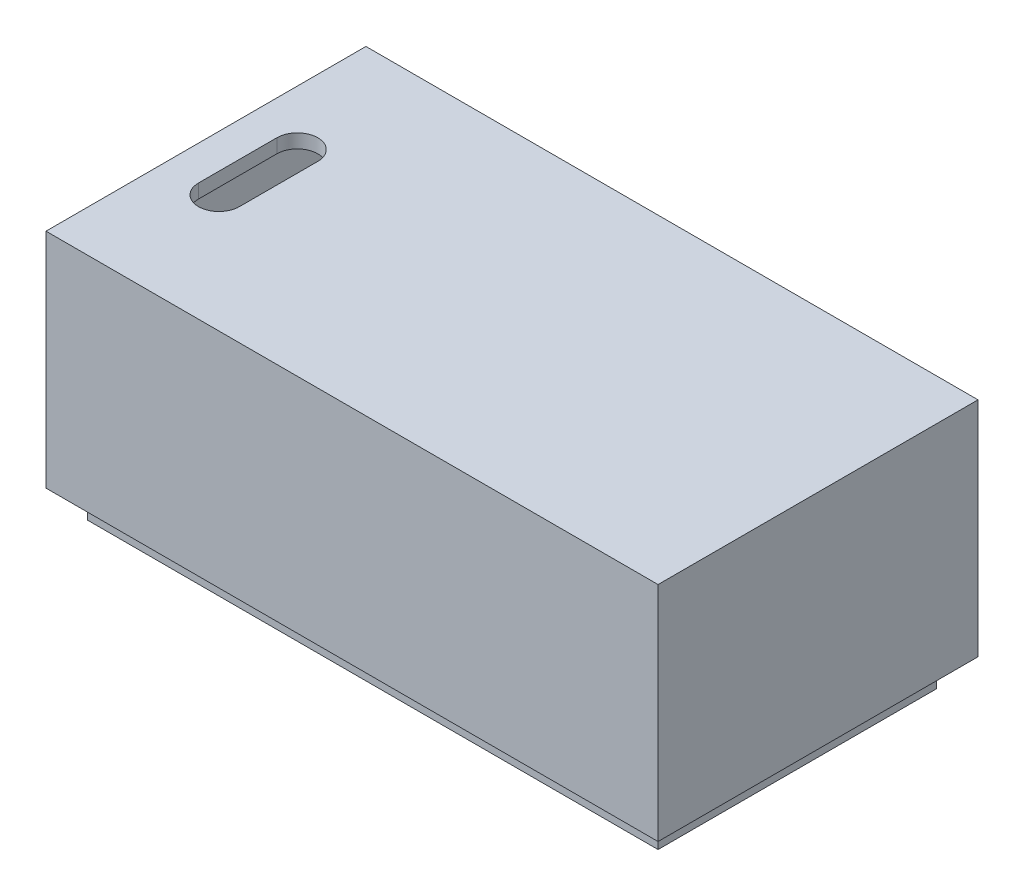
ISO-10303-21;
HEADER;
FILE_DESCRIPTION(('STEP AP214'),'2;1');
FILE_NAME('part.step','',(''),(''),'','','');
FILE_SCHEMA(('AUTOMOTIVE_DESIGN { 1 0 10303 214 1 1 1 1 }'));
ENDSEC;
DATA;
#1=APPLICATION_CONTEXT('core data for automotive mechanical design processes');
#2=APPLICATION_PROTOCOL_DEFINITION('international standard','automotive_design',2000,#1);
#3=PRODUCT_CONTEXT('',#1,'mechanical');
#4=PRODUCT('Part','Part','',(#3));
#5=PRODUCT_RELATED_PRODUCT_CATEGORY('part','',(#4));
#6=PRODUCT_DEFINITION_FORMATION('','',#4);
#7=PRODUCT_DEFINITION_CONTEXT('part definition',#1,'design');
#8=PRODUCT_DEFINITION('design','',#6,#7);
#9=PRODUCT_DEFINITION_SHAPE('','',#8);
#10=(LENGTH_UNIT() NAMED_UNIT(*) SI_UNIT(.MILLI.,.METRE.));
#11=(NAMED_UNIT(*) PLANE_ANGLE_UNIT() SI_UNIT($,.RADIAN.));
#12=(NAMED_UNIT(*) SI_UNIT($,.STERADIAN.) SOLID_ANGLE_UNIT());
#13=UNCERTAINTY_MEASURE_WITH_UNIT(LENGTH_MEASURE(1.E-05),#10,'distance_accuracy_value','');
#14=(GEOMETRIC_REPRESENTATION_CONTEXT(3) GLOBAL_UNCERTAINTY_ASSIGNED_CONTEXT((#13)) GLOBAL_UNIT_ASSIGNED_CONTEXT((#10,
#11,#12)) REPRESENTATION_CONTEXT('',''));
#15=CARTESIAN_POINT('',(0.,0.,0.));
#16=DIRECTION('',(0.,0.,1.));
#17=DIRECTION('',(1.,0.,0.));
#18=AXIS2_PLACEMENT_3D('',#15,#16,#17);
#19=CARTESIAN_POINT('',(0.,20.32,0.));
#20=DIRECTION('',(1.,0.,0.));
#21=DIRECTION('',(0.,0.,-1.));
#22=AXIS2_PLACEMENT_3D('',#19,#20,#21);
#23=PLANE('',#22);
#24=DIRECTION('',(0.,0.,1.));
#25=VECTOR('',#24,1.);
#26=CARTESIAN_POINT('',(0.,0.,0.));
#27=LINE('',#26,#25);
#28=CARTESIAN_POINT('',(0.,0.,-29.21));
#29=VERTEX_POINT('',#28);
#30=CARTESIAN_POINT('',(0.,0.,0.));
#31=VERTEX_POINT('',#30);
#32=EDGE_CURVE('E317',#29,#31,#27,.T.);
#33=ORIENTED_EDGE('',*,*,#32,.T.);
#34=DIRECTION('',(0.,-1.,0.));
#35=VECTOR('',#34,1.);
#36=CARTESIAN_POINT('',(0.,20.32,0.));
#37=LINE('',#36,#35);
#38=CARTESIAN_POINT('',(0.,20.32,0.));
#39=VERTEX_POINT('',#38);
#40=EDGE_CURVE('E11',#39,#31,#37,.T.);
#41=ORIENTED_EDGE('',*,*,#40,.F.);
#42=DIRECTION('',(0.,0.,1.));
#43=VECTOR('',#42,1.);
#44=CARTESIAN_POINT('',(0.,20.32,0.));
#45=LINE('',#44,#43);
#46=CARTESIAN_POINT('',(0.,20.32,-29.21));
#47=VERTEX_POINT('',#46);
#48=EDGE_CURVE('E327',#47,#39,#45,.T.);
#49=ORIENTED_EDGE('',*,*,#48,.F.);
#50=DIRECTION('',(0.,-1.,0.));
#51=VECTOR('',#50,1.);
#52=CARTESIAN_POINT('',(0.,20.32,-29.21));
#53=LINE('',#52,#51);
#54=EDGE_CURVE('E341',#47,#29,#53,.T.);
#55=ORIENTED_EDGE('',*,*,#54,.T.);
#56=EDGE_LOOP('',(#33,#41,#49,#55));
#57=FACE_BOUND('',#56,.T.);
#58=ADVANCED_FACE('F43',(#57),#23,.F.);
#59=CARTESIAN_POINT('',(0.,20.32,0.));
#60=DIRECTION('',(0.,0.,-1.));
#61=DIRECTION('',(-1.,0.,0.));
#62=AXIS2_PLACEMENT_3D('',#59,#60,#61);
#63=PLANE('',#62);
#64=DIRECTION('',(1.,0.,0.));
#65=VECTOR('',#64,1.);
#66=CARTESIAN_POINT('',(0.,0.,0.));
#67=LINE('',#66,#65);
#68=CARTESIAN_POINT('',(55.88,0.,0.));
#69=VERTEX_POINT('',#68);
#70=EDGE_CURVE('E345',#31,#69,#67,.T.);
#71=ORIENTED_EDGE('',*,*,#70,.T.);
#72=DIRECTION('',(0.,-1.,0.));
#73=VECTOR('',#72,1.);
#74=CARTESIAN_POINT('',(55.88,20.32,0.));
#75=LINE('',#74,#73);
#76=CARTESIAN_POINT('',(55.88,20.32,0.));
#77=VERTEX_POINT('',#76);
#78=EDGE_CURVE('E51',#77,#69,#75,.T.);
#79=ORIENTED_EDGE('',*,*,#78,.F.);
#80=DIRECTION('',(1.,0.,0.));
#81=VECTOR('',#80,1.);
#82=CARTESIAN_POINT('',(0.,20.32,0.));
#83=LINE('',#82,#81);
#84=EDGE_CURVE('E331',#39,#77,#83,.T.);
#85=ORIENTED_EDGE('',*,*,#84,.F.);
#86=ORIENTED_EDGE('',*,*,#40,.T.);
#87=EDGE_LOOP('',(#71,#79,#85,#86));
#88=FACE_BOUND('',#87,.T.);
#89=ADVANCED_FACE('F380',(#88),#63,.F.);
#90=CARTESIAN_POINT('',(55.88,20.32,0.));
#91=DIRECTION('',(-1.,0.,0.));
#92=DIRECTION('',(0.,0.,1.));
#93=AXIS2_PLACEMENT_3D('',#90,#91,#92);
#94=PLANE('',#93);
#95=DIRECTION('',(0.,0.,-1.));
#96=VECTOR('',#95,1.);
#97=CARTESIAN_POINT('',(55.88,0.,0.));
#98=LINE('',#97,#96);
#99=CARTESIAN_POINT('',(55.88,0.,-29.21));
#100=VERTEX_POINT('',#99);
#101=EDGE_CURVE('E348',#69,#100,#98,.T.);
#102=ORIENTED_EDGE('',*,*,#101,.T.);
#103=DIRECTION('',(0.,-1.,0.));
#104=VECTOR('',#103,1.);
#105=CARTESIAN_POINT('',(55.88,20.32,-29.21));
#106=LINE('',#105,#104);
#107=CARTESIAN_POINT('',(55.88,20.32,-29.21));
#108=VERTEX_POINT('',#107);
#109=EDGE_CURVE('E356',#108,#100,#106,.T.);
#110=ORIENTED_EDGE('',*,*,#109,.F.);
#111=DIRECTION('',(0.,0.,-1.));
#112=VECTOR('',#111,1.);
#113=CARTESIAN_POINT('',(55.88,20.32,0.));
#114=LINE('',#113,#112);
#115=EDGE_CURVE('E335',#77,#108,#114,.T.);
#116=ORIENTED_EDGE('',*,*,#115,.F.);
#117=ORIENTED_EDGE('',*,*,#78,.T.);
#118=EDGE_LOOP('',(#102,#110,#116,#117));
#119=FACE_BOUND('',#118,.T.);
#120=ADVANCED_FACE('F365',(#119),#94,.F.);
#121=CARTESIAN_POINT('',(0.,20.32,-29.21));
#122=DIRECTION('',(0.,0.,1.));
#123=DIRECTION('',(1.,0.,0.));
#124=AXIS2_PLACEMENT_3D('',#121,#122,#123);
#125=PLANE('',#124);
#126=DIRECTION('',(0.,1.,0.));
#127=VECTOR('',#126,1.);
#128=CARTESIAN_POINT('',(1.27,1.27,-29.21));
#129=LINE('',#128,#127);
#130=CARTESIAN_POINT('',(1.27,1.27,-29.21));
#131=VERTEX_POINT('',#130);
#132=CARTESIAN_POINT('',(1.27,19.05,-29.21));
#133=VERTEX_POINT('',#132);
#134=EDGE_CURVE('E303',#131,#133,#129,.T.);
#135=ORIENTED_EDGE('',*,*,#134,.F.);
#136=DIRECTION('',(-1.,0.,0.));
#137=VECTOR('',#136,1.);
#138=CARTESIAN_POINT('',(54.61,1.27,-29.21));
#139=LINE('',#138,#137);
#140=CARTESIAN_POINT('',(54.61,1.27,-29.21));
#141=VERTEX_POINT('',#140);
#142=EDGE_CURVE('E282',#141,#131,#139,.T.);
#143=ORIENTED_EDGE('',*,*,#142,.F.);
#144=DIRECTION('',(0.,-1.,0.));
#145=VECTOR('',#144,1.);
#146=CARTESIAN_POINT('',(54.61,19.05,-29.21));
#147=LINE('',#146,#145);
#148=CARTESIAN_POINT('',(54.61,19.05,-29.21));
#149=VERTEX_POINT('',#148);
#150=EDGE_CURVE('E288',#149,#141,#147,.T.);
#151=ORIENTED_EDGE('',*,*,#150,.F.);
#152=DIRECTION('',(1.,0.,0.));
#153=VECTOR('',#152,1.);
#154=CARTESIAN_POINT('',(1.27,19.05,-29.21));
#155=LINE('',#154,#153);
#156=EDGE_CURVE('E307',#133,#149,#155,.T.);
#157=ORIENTED_EDGE('',*,*,#156,.F.);
#158=EDGE_LOOP('',(#135,#143,#151,#157));
#159=FACE_BOUND('',#158,.T.);
#160=DIRECTION('',(-1.,0.,0.));
#161=VECTOR('',#160,1.);
#162=CARTESIAN_POINT('',(0.,0.,-29.21));
#163=LINE('',#162,#161);
#164=EDGE_CURVE('E332',#100,#29,#163,.T.);
#165=ORIENTED_EDGE('',*,*,#164,.T.);
#166=ORIENTED_EDGE('',*,*,#54,.F.);
#167=DIRECTION('',(-1.,0.,0.));
#168=VECTOR('',#167,1.);
#169=CARTESIAN_POINT('',(0.,20.32,-29.21));
#170=LINE('',#169,#168);
#171=EDGE_CURVE('E338',#108,#47,#170,.T.);
#172=ORIENTED_EDGE('',*,*,#171,.F.);
#173=ORIENTED_EDGE('',*,*,#109,.T.);
#174=EDGE_LOOP('',(#165,#166,#172,#173));
#175=FACE_BOUND('',#174,.T.);
#176=ADVANCED_FACE('F373',(#159,#175),#125,.F.);
#177=CARTESIAN_POINT('',(0.,20.32,0.));
#178=DIRECTION('',(0.,-1.,0.));
#179=DIRECTION('',(0.,0.,-1.));
#180=AXIS2_PLACEMENT_3D('',#177,#178,#179);
#181=PLANE('',#180);
#182=CARTESIAN_POINT('',(5.02147706146975,20.32,-10.7691290721729));
#183=DIRECTION('',(0.,1.,0.));
#184=DIRECTION('',(0.,0.,1.));
#185=AXIS2_PLACEMENT_3D('',#182,#183,#184);
#186=CIRCLE('',#185,1.86958414969726);
#187=CARTESIAN_POINT('',(3.15189291177249,20.32,-10.7691290721729));
#188=VERTEX_POINT('',#187);
#189=CARTESIAN_POINT('',(6.89106121116701,20.32,-10.7691290721729));
#190=VERTEX_POINT('',#189);
#191=EDGE_CURVE('E247',#188,#190,#186,.T.);
#192=ORIENTED_EDGE('',*,*,#191,.F.);
#193=DIRECTION('',(0.,0.,1.));
#194=VECTOR('',#193,1.);
#195=CARTESIAN_POINT('',(3.15189291177249,20.32,-17.9251235761866));
#196=LINE('',#195,#194);
#197=CARTESIAN_POINT('',(3.15189291177249,20.32,-17.9251235761866));
#198=VERTEX_POINT('',#197);
#199=EDGE_CURVE('E251',#198,#188,#196,.T.);
#200=ORIENTED_EDGE('',*,*,#199,.F.);
#201=CARTESIAN_POINT('',(5.02147706146975,20.32,-17.9251235761866));
#202=DIRECTION('',(0.,1.,0.));
#203=DIRECTION('',(0.,0.,1.));
#204=AXIS2_PLACEMENT_3D('',#201,#202,#203);
#205=CIRCLE('',#204,1.86958414969726);
#206=CARTESIAN_POINT('',(6.89106121116701,20.32,-17.9251235761866));
#207=VERTEX_POINT('',#206);
#208=EDGE_CURVE('E255',#207,#198,#205,.T.);
#209=ORIENTED_EDGE('',*,*,#208,.F.);
#210=DIRECTION('',(0.,0.,-1.));
#211=VECTOR('',#210,1.);
#212=CARTESIAN_POINT('',(6.89106121116701,20.32,-17.9251235761866));
#213=LINE('',#212,#211);
#214=EDGE_CURVE('E243',#190,#207,#213,.T.);
#215=ORIENTED_EDGE('',*,*,#214,.F.);
#216=EDGE_LOOP('',(#192,#200,#209,#215));
#217=FACE_BOUND('',#216,.T.);
#218=ORIENTED_EDGE('',*,*,#48,.T.);
#219=ORIENTED_EDGE('',*,*,#84,.T.);
#220=ORIENTED_EDGE('',*,*,#115,.T.);
#221=ORIENTED_EDGE('',*,*,#171,.T.);
#222=EDGE_LOOP('',(#218,#219,#220,#221));
#223=FACE_BOUND('',#222,.T.);
#224=ADVANCED_FACE('F379',(#217,#223),#181,.F.);
#225=CARTESIAN_POINT('',(0.,0.,0.));
#226=DIRECTION('',(0.,-1.,0.));
#227=DIRECTION('',(0.,0.,-1.));
#228=AXIS2_PLACEMENT_3D('',#225,#226,#227);
#229=PLANE('',#228);
#230=DIRECTION('',(0.,0.,1.));
#231=VECTOR('',#230,1.);
#232=CARTESIAN_POINT('',(53.975,0.,-27.305));
#233=LINE('',#232,#231);
#234=CARTESIAN_POINT('',(53.975,0.,-2.667));
#235=VERTEX_POINT('',#234);
#236=CARTESIAN_POINT('',(53.975,0.,-1.905));
#237=VERTEX_POINT('',#236);
#238=EDGE_CURVE('E193',#235,#237,#233,.T.);
#239=ORIENTED_EDGE('',*,*,#238,.F.);
#240=DIRECTION('',(-1.,0.,0.));
#241=VECTOR('',#240,1.);
#242=CARTESIAN_POINT('',(55.881,0.,-2.667));
#243=LINE('',#242,#241);
#244=CARTESIAN_POINT('',(1.905,0.,-2.667));
#245=VERTEX_POINT('',#244);
#246=EDGE_CURVE('E178',#235,#245,#243,.T.);
#247=ORIENTED_EDGE('',*,*,#246,.T.);
#248=DIRECTION('',(0.,0.,-1.));
#249=VECTOR('',#248,1.);
#250=CARTESIAN_POINT('',(1.905,0.,-1.905));
#251=LINE('',#250,#249);
#252=CARTESIAN_POINT('',(1.905,0.,-1.905));
#253=VERTEX_POINT('',#252);
#254=EDGE_CURVE('E219',#253,#245,#251,.T.);
#255=ORIENTED_EDGE('',*,*,#254,.F.);
#256=DIRECTION('',(-1.,0.,0.));
#257=VECTOR('',#256,1.);
#258=CARTESIAN_POINT('',(53.975,0.,-1.905));
#259=LINE('',#258,#257);
#260=EDGE_CURVE('E202',#237,#253,#259,.T.);
#261=ORIENTED_EDGE('',*,*,#260,.F.);
#262=EDGE_LOOP('',(#239,#247,#255,#261));
#263=FACE_BOUND('',#262,.T.);
#264=DIRECTION('',(1.,0.,0.));
#265=VECTOR('',#264,1.);
#266=CARTESIAN_POINT('',(1.905,0.,-27.305));
#267=LINE('',#266,#265);
#268=CARTESIAN_POINT('',(1.905,0.,-27.305));
#269=VERTEX_POINT('',#268);
#270=CARTESIAN_POINT('',(53.975,0.,-27.305));
#271=VERTEX_POINT('',#270);
#272=EDGE_CURVE('E206',#269,#271,#267,.T.);
#273=ORIENTED_EDGE('',*,*,#272,.F.);
#274=CARTESIAN_POINT('',(1.905,0.,-26.543));
#275=VERTEX_POINT('',#274);
#276=EDGE_CURVE('E218',#275,#269,#251,.T.);
#277=ORIENTED_EDGE('',*,*,#276,.F.);
#278=DIRECTION('',(-1.,0.,0.));
#279=VECTOR('',#278,1.);
#280=CARTESIAN_POINT('',(55.881,0.,-26.543));
#281=LINE('',#280,#279);
#282=CARTESIAN_POINT('',(53.975,0.,-26.543));
#283=VERTEX_POINT('',#282);
#284=EDGE_CURVE('E187',#283,#275,#281,.T.);
#285=ORIENTED_EDGE('',*,*,#284,.F.);
#286=EDGE_CURVE('E205',#271,#283,#233,.T.);
#287=ORIENTED_EDGE('',*,*,#286,.F.);
#288=EDGE_LOOP('',(#273,#277,#285,#287));
#289=FACE_BOUND('',#288,.T.);
#290=ORIENTED_EDGE('',*,*,#32,.F.);
#291=ORIENTED_EDGE('',*,*,#164,.F.);
#292=ORIENTED_EDGE('',*,*,#101,.F.);
#293=ORIENTED_EDGE('',*,*,#70,.F.);
#294=EDGE_LOOP('',(#290,#291,#292,#293));
#295=FACE_BOUND('',#294,.T.);
#296=ADVANCED_FACE('F199',(#263,#289,#295),#229,.T.);
#297=CARTESIAN_POINT('',(54.61,1.27,-1.26999999999999));
#298=DIRECTION('',(0.,-1.,0.));
#299=DIRECTION('',(0.,0.,-1.));
#300=AXIS2_PLACEMENT_3D('',#297,#298,#299);
#301=PLANE('',#300);
#302=ORIENTED_EDGE('',*,*,#142,.T.);
#303=DIRECTION('',(0.,0.,-1.));
#304=VECTOR('',#303,1.);
#305=CARTESIAN_POINT('',(1.27,1.27,-1.26999999999999));
#306=LINE('',#305,#304);
#307=CARTESIAN_POINT('',(1.27,1.27,-1.26999999999999));
#308=VERTEX_POINT('',#307);
#309=EDGE_CURVE('E300',#308,#131,#306,.T.);
#310=ORIENTED_EDGE('',*,*,#309,.F.);
#311=DIRECTION('',(-1.,0.,0.));
#312=VECTOR('',#311,1.);
#313=CARTESIAN_POINT('',(54.61,1.27,-1.26999999999999));
#314=LINE('',#313,#312);
#315=CARTESIAN_POINT('',(54.61,1.27,-1.26999999999999));
#316=VERTEX_POINT('',#315);
#317=EDGE_CURVE('E283',#316,#308,#314,.T.);
#318=ORIENTED_EDGE('',*,*,#317,.F.);
#319=DIRECTION('',(0.,0.,-1.));
#320=VECTOR('',#319,1.);
#321=CARTESIAN_POINT('',(54.61,1.27,-1.26999999999999));
#322=LINE('',#321,#320);
#323=EDGE_CURVE('E314',#316,#141,#322,.T.);
#324=ORIENTED_EDGE('',*,*,#323,.T.);
#325=EDGE_LOOP('',(#302,#310,#318,#324));
#326=FACE_BOUND('',#325,.T.);
#327=ADVANCED_FACE('F393',(#326),#301,.F.);
#328=CARTESIAN_POINT('',(54.61,19.05,-1.26999999999999));
#329=DIRECTION('',(1.,0.,0.));
#330=DIRECTION('',(0.,0.,-1.));
#331=AXIS2_PLACEMENT_3D('',#328,#329,#330);
#332=PLANE('',#331);
#333=ORIENTED_EDGE('',*,*,#150,.T.);
#334=ORIENTED_EDGE('',*,*,#323,.F.);
#335=DIRECTION('',(0.,-1.,0.));
#336=VECTOR('',#335,1.);
#337=CARTESIAN_POINT('',(54.61,19.05,-1.26999999999999));
#338=LINE('',#337,#336);
#339=CARTESIAN_POINT('',(54.61,19.05,-1.26999999999999));
#340=VERTEX_POINT('',#339);
#341=EDGE_CURVE('E296',#340,#316,#338,.T.);
#342=ORIENTED_EDGE('',*,*,#341,.F.);
#343=DIRECTION('',(0.,0.,-1.));
#344=VECTOR('',#343,1.);
#345=CARTESIAN_POINT('',(54.61,19.05,-1.26999999999999));
#346=LINE('',#345,#344);
#347=EDGE_CURVE('E318',#340,#149,#346,.T.);
#348=ORIENTED_EDGE('',*,*,#347,.T.);
#349=EDGE_LOOP('',(#333,#334,#342,#348));
#350=FACE_BOUND('',#349,.T.);
#351=ADVANCED_FACE('F399',(#350),#332,.F.);
#352=CARTESIAN_POINT('',(1.27,19.05,-1.26999999999999));
#353=DIRECTION('',(0.,1.,0.));
#354=DIRECTION('',(0.,0.,1.));
#355=AXIS2_PLACEMENT_3D('',#352,#353,#354);
#356=PLANE('',#355);
#357=CARTESIAN_POINT('',(5.02147706146975,19.05,-17.9251235761866));
#358=DIRECTION('',(0.,1.,0.));
#359=DIRECTION('',(0.,0.,1.));
#360=AXIS2_PLACEMENT_3D('',#357,#358,#359);
#361=CIRCLE('',#360,1.86958414969726);
#362=CARTESIAN_POINT('',(3.15189291177249,19.05,-17.9251235761866));
#363=VERTEX_POINT('',#362);
#364=CARTESIAN_POINT('',(6.89106121116701,19.05,-17.9251235761866));
#365=VERTEX_POINT('',#364);
#366=EDGE_CURVE('E242',#363,#365,#361,.F.);
#367=ORIENTED_EDGE('',*,*,#366,.F.);
#368=DIRECTION('',(0.,0.,-1.));
#369=VECTOR('',#368,1.);
#370=CARTESIAN_POINT('',(3.15189291177249,19.05,-17.9251235761866));
#371=LINE('',#370,#369);
#372=CARTESIAN_POINT('',(3.15189291177249,19.05,-10.7691290721729));
#373=VERTEX_POINT('',#372);
#374=EDGE_CURVE('E239',#373,#363,#371,.T.);
#375=ORIENTED_EDGE('',*,*,#374,.F.);
#376=CARTESIAN_POINT('',(5.02147706146975,19.05,-10.7691290721729));
#377=DIRECTION('',(0.,1.,0.));
#378=DIRECTION('',(0.,0.,1.));
#379=AXIS2_PLACEMENT_3D('',#376,#377,#378);
#380=CIRCLE('',#379,1.86958414969726);
#381=CARTESIAN_POINT('',(6.89106121116701,19.05,-10.7691290721729));
#382=VERTEX_POINT('',#381);
#383=EDGE_CURVE('E259',#382,#373,#380,.F.);
#384=ORIENTED_EDGE('',*,*,#383,.F.);
#385=DIRECTION('',(0.,0.,1.));
#386=VECTOR('',#385,1.);
#387=CARTESIAN_POINT('',(6.89106121116701,19.05,-17.9251235761866));
#388=LINE('',#387,#386);
#389=EDGE_CURVE('E263',#365,#382,#388,.T.);
#390=ORIENTED_EDGE('',*,*,#389,.F.);
#391=EDGE_LOOP('',(#367,#375,#384,#390));
#392=FACE_BOUND('',#391,.T.);
#393=ORIENTED_EDGE('',*,*,#156,.T.);
#394=ORIENTED_EDGE('',*,*,#347,.F.);
#395=DIRECTION('',(1.,0.,0.));
#396=VECTOR('',#395,1.);
#397=CARTESIAN_POINT('',(1.27,19.05,-1.26999999999999));
#398=LINE('',#397,#396);
#399=CARTESIAN_POINT('',(1.27,19.05,-1.26999999999999));
#400=VERTEX_POINT('',#399);
#401=EDGE_CURVE('E292',#400,#340,#398,.T.);
#402=ORIENTED_EDGE('',*,*,#401,.F.);
#403=DIRECTION('',(0.,0.,-1.));
#404=VECTOR('',#403,1.);
#405=CARTESIAN_POINT('',(1.27,19.05,-1.26999999999999));
#406=LINE('',#405,#404);
#407=EDGE_CURVE('E321',#400,#133,#406,.T.);
#408=ORIENTED_EDGE('',*,*,#407,.T.);
#409=EDGE_LOOP('',(#393,#394,#402,#408));
#410=FACE_BOUND('',#409,.T.);
#411=ADVANCED_FACE('F405',(#392,#410),#356,.F.);
#412=CARTESIAN_POINT('',(1.27,1.27,-1.26999999999999));
#413=DIRECTION('',(-1.,0.,0.));
#414=DIRECTION('',(0.,0.,1.));
#415=AXIS2_PLACEMENT_3D('',#412,#413,#414);
#416=PLANE('',#415);
#417=ORIENTED_EDGE('',*,*,#134,.T.);
#418=ORIENTED_EDGE('',*,*,#407,.F.);
#419=DIRECTION('',(0.,1.,0.));
#420=VECTOR('',#419,1.);
#421=CARTESIAN_POINT('',(1.27,1.27,-1.26999999999999));
#422=LINE('',#421,#420);
#423=EDGE_CURVE('E287',#308,#400,#422,.T.);
#424=ORIENTED_EDGE('',*,*,#423,.F.);
#425=ORIENTED_EDGE('',*,*,#309,.T.);
#426=EDGE_LOOP('',(#417,#418,#424,#425));
#427=FACE_BOUND('',#426,.T.);
#428=ADVANCED_FACE('F401',(#427),#416,.F.);
#429=CARTESIAN_POINT('',(0.,0.,-1.26999999999999));
#430=DIRECTION('',(0.,0.,-1.));
#431=DIRECTION('',(-1.,0.,0.));
#432=AXIS2_PLACEMENT_3D('',#429,#430,#431);
#433=PLANE('',#432);
#434=ORIENTED_EDGE('',*,*,#317,.T.);
#435=ORIENTED_EDGE('',*,*,#423,.T.);
#436=ORIENTED_EDGE('',*,*,#401,.T.);
#437=ORIENTED_EDGE('',*,*,#341,.T.);
#438=EDGE_LOOP('',(#434,#435,#436,#437));
#439=FACE_BOUND('',#438,.T.);
#440=ADVANCED_FACE('F404',(#439),#433,.T.);
#441=CARTESIAN_POINT('',(3.15189291177249,-0.001000000000001,-17.9251235761866));
#442=DIRECTION('',(-1.,0.,0.));
#443=DIRECTION('',(0.,0.,1.));
#444=AXIS2_PLACEMENT_3D('',#441,#442,#443);
#445=PLANE('',#444);
#446=ORIENTED_EDGE('',*,*,#374,.T.);
#447=DIRECTION('',(0.,1.,0.));
#448=VECTOR('',#447,1.);
#449=CARTESIAN_POINT('',(3.15189291177249,-0.001000000000001,-17.9251235761866));
#450=LINE('',#449,#448);
#451=EDGE_CURVE('E274',#363,#198,#450,.T.);
#452=ORIENTED_EDGE('',*,*,#451,.T.);
#453=ORIENTED_EDGE('',*,*,#199,.T.);
#454=DIRECTION('',(0.,1.,0.));
#455=VECTOR('',#454,1.);
#456=CARTESIAN_POINT('',(3.15189291177249,-0.001000000000001,-10.7691290721729));
#457=LINE('',#456,#455);
#458=EDGE_CURVE('E246',#373,#188,#457,.T.);
#459=ORIENTED_EDGE('',*,*,#458,.F.);
#460=EDGE_LOOP('',(#446,#452,#453,#459));
#461=FACE_BOUND('',#460,.T.);
#462=ADVANCED_FACE('F415',(#461),#445,.F.);
#463=CARTESIAN_POINT('',(5.02147706146975,-0.001000000000001,-10.7691290721729));
#464=DIRECTION('',(0.,1.,0.));
#465=DIRECTION('',(0.,0.,1.));
#466=AXIS2_PLACEMENT_3D('',#463,#464,#465);
#467=CYLINDRICAL_SURFACE('',#466,1.86958414969726);
#468=ORIENTED_EDGE('',*,*,#383,.T.);
#469=ORIENTED_EDGE('',*,*,#458,.T.);
#470=ORIENTED_EDGE('',*,*,#191,.T.);
#471=DIRECTION('',(0.,1.,0.));
#472=VECTOR('',#471,1.);
#473=CARTESIAN_POINT('',(6.89106121116701,-0.001000000000001,-10.7691290721729));
#474=LINE('',#473,#472);
#475=EDGE_CURVE('E275',#382,#190,#474,.T.);
#476=ORIENTED_EDGE('',*,*,#475,.F.);
#477=EDGE_LOOP('',(#468,#469,#470,#476));
#478=FACE_BOUND('',#477,.T.);
#479=ADVANCED_FACE('F419',(#478),#467,.F.);
#480=CARTESIAN_POINT('',(6.89106121116701,-0.001000000000001,-17.9251235761866));
#481=DIRECTION('',(1.,0.,0.));
#482=DIRECTION('',(0.,0.,-1.));
#483=AXIS2_PLACEMENT_3D('',#480,#481,#482);
#484=PLANE('',#483);
#485=ORIENTED_EDGE('',*,*,#389,.T.);
#486=ORIENTED_EDGE('',*,*,#475,.T.);
#487=ORIENTED_EDGE('',*,*,#214,.T.);
#488=DIRECTION('',(0.,1.,0.));
#489=VECTOR('',#488,1.);
#490=CARTESIAN_POINT('',(6.89106121116701,-0.001000000000001,-17.9251235761866));
#491=LINE('',#490,#489);
#492=EDGE_CURVE('E270',#365,#207,#491,.T.);
#493=ORIENTED_EDGE('',*,*,#492,.F.);
#494=EDGE_LOOP('',(#485,#486,#487,#493));
#495=FACE_BOUND('',#494,.T.);
#496=ADVANCED_FACE('F423',(#495),#484,.F.);
#497=CARTESIAN_POINT('',(5.02147706146975,-0.001000000000001,-17.9251235761866));
#498=DIRECTION('',(0.,1.,0.));
#499=DIRECTION('',(0.,0.,1.));
#500=AXIS2_PLACEMENT_3D('',#497,#498,#499);
#501=CYLINDRICAL_SURFACE('',#500,1.86958414969726);
#502=ORIENTED_EDGE('',*,*,#366,.T.);
#503=ORIENTED_EDGE('',*,*,#492,.T.);
#504=ORIENTED_EDGE('',*,*,#208,.T.);
#505=ORIENTED_EDGE('',*,*,#451,.F.);
#506=EDGE_LOOP('',(#502,#503,#504,#505));
#507=FACE_BOUND('',#506,.T.);
#508=ADVANCED_FACE('F427',(#507),#501,.F.);
#509=CARTESIAN_POINT('',(1.905,-2.54,-27.305));
#510=DIRECTION('',(0.,0.,1.));
#511=DIRECTION('',(1.,0.,0.));
#512=AXIS2_PLACEMENT_3D('',#509,#510,#511);
#513=PLANE('',#512);
#514=ORIENTED_EDGE('',*,*,#272,.T.);
#515=DIRECTION('',(0.,1.,0.));
#516=VECTOR('',#515,1.);
#517=CARTESIAN_POINT('',(53.975,-2.54,-27.305));
#518=LINE('',#517,#516);
#519=CARTESIAN_POINT('',(53.975,-2.54,-27.305));
#520=VERTEX_POINT('',#519);
#521=EDGE_CURVE('E235',#520,#271,#518,.T.);
#522=ORIENTED_EDGE('',*,*,#521,.F.);
#523=DIRECTION('',(1.,0.,0.));
#524=VECTOR('',#523,1.);
#525=CARTESIAN_POINT('',(1.905,-2.54,-27.305));
#526=LINE('',#525,#524);
#527=CARTESIAN_POINT('',(1.905,-2.54,-27.305));
#528=VERTEX_POINT('',#527);
#529=EDGE_CURVE('E222',#528,#520,#526,.T.);
#530=ORIENTED_EDGE('',*,*,#529,.F.);
#531=DIRECTION('',(0.,1.,0.));
#532=VECTOR('',#531,1.);
#533=CARTESIAN_POINT('',(1.905,-2.54,-27.305));
#534=LINE('',#533,#532);
#535=EDGE_CURVE('E223',#528,#269,#534,.T.);
#536=ORIENTED_EDGE('',*,*,#535,.T.);
#537=EDGE_LOOP('',(#514,#522,#530,#536));
#538=FACE_BOUND('',#537,.T.);
#539=ADVANCED_FACE('F431',(#538),#513,.F.);
#540=CARTESIAN_POINT('',(53.975,-2.54,-27.305));
#541=DIRECTION('',(-1.,0.,0.));
#542=DIRECTION('',(0.,0.,1.));
#543=AXIS2_PLACEMENT_3D('',#540,#541,#542);
#544=PLANE('',#543);
#545=DIRECTION('',(0.,0.,-1.));
#546=VECTOR('',#545,1.);
#547=CARTESIAN_POINT('',(53.975,-1.778,-2.667));
#548=LINE('',#547,#546);
#549=CARTESIAN_POINT('',(53.975,-1.778,-2.667));
#550=VERTEX_POINT('',#549);
#551=CARTESIAN_POINT('',(53.975,-1.778,-26.543));
#552=VERTEX_POINT('',#551);
#553=EDGE_CURVE('E196',#550,#552,#548,.T.);
#554=ORIENTED_EDGE('',*,*,#553,.F.);
#555=DIRECTION('',(0.,-1.,0.));
#556=VECTOR('',#555,1.);
#557=CARTESIAN_POINT('',(53.975,0.,-2.667));
#558=LINE('',#557,#556);
#559=EDGE_CURVE('E181',#235,#550,#558,.T.);
#560=ORIENTED_EDGE('',*,*,#559,.F.);
#561=ORIENTED_EDGE('',*,*,#238,.T.);
#562=DIRECTION('',(0.,1.,0.));
#563=VECTOR('',#562,1.);
#564=CARTESIAN_POINT('',(53.975,-2.54,-1.905));
#565=LINE('',#564,#563);
#566=CARTESIAN_POINT('',(53.975,-2.54,-1.905));
#567=VERTEX_POINT('',#566);
#568=EDGE_CURVE('E232',#567,#237,#565,.T.);
#569=ORIENTED_EDGE('',*,*,#568,.F.);
#570=DIRECTION('',(0.,0.,1.));
#571=VECTOR('',#570,1.);
#572=CARTESIAN_POINT('',(53.975,-2.54,-27.305));
#573=LINE('',#572,#571);
#574=EDGE_CURVE('E484',#520,#567,#573,.T.);
#575=ORIENTED_EDGE('',*,*,#574,.F.);
#576=ORIENTED_EDGE('',*,*,#521,.T.);
#577=ORIENTED_EDGE('',*,*,#286,.T.);
#578=DIRECTION('',(0.,1.,0.));
#579=VECTOR('',#578,1.);
#580=CARTESIAN_POINT('',(53.975,-1.778,-26.543));
#581=LINE('',#580,#579);
#582=EDGE_CURVE('E58',#552,#283,#581,.T.);
#583=ORIENTED_EDGE('',*,*,#582,.F.);
#584=EDGE_LOOP('',(#554,#560,#561,#569,#575,#576,#577,#583));
#585=FACE_BOUND('',#584,.T.);
#586=ADVANCED_FACE('F191',(#585),#544,.F.);
#587=CARTESIAN_POINT('',(53.975,-2.54,-1.905));
#588=DIRECTION('',(0.,0.,-1.));
#589=DIRECTION('',(-1.,0.,0.));
#590=AXIS2_PLACEMENT_3D('',#587,#588,#589);
#591=PLANE('',#590);
#592=ORIENTED_EDGE('',*,*,#260,.T.);
#593=DIRECTION('',(0.,1.,0.));
#594=VECTOR('',#593,1.);
#595=CARTESIAN_POINT('',(1.905,-2.54,-1.905));
#596=LINE('',#595,#594);
#597=CARTESIAN_POINT('',(1.905,-2.54,-1.905));
#598=VERTEX_POINT('',#597);
#599=EDGE_CURVE('E227',#598,#253,#596,.T.);
#600=ORIENTED_EDGE('',*,*,#599,.F.);
#601=DIRECTION('',(-1.,0.,0.));
#602=VECTOR('',#601,1.);
#603=CARTESIAN_POINT('',(53.975,-2.54,-1.905));
#604=LINE('',#603,#602);
#605=EDGE_CURVE('E487',#567,#598,#604,.T.);
#606=ORIENTED_EDGE('',*,*,#605,.F.);
#607=ORIENTED_EDGE('',*,*,#568,.T.);
#608=EDGE_LOOP('',(#592,#600,#606,#607));
#609=FACE_BOUND('',#608,.T.);
#610=ADVANCED_FACE('F438',(#609),#591,.F.);
#611=CARTESIAN_POINT('',(1.905,-2.54,-1.905));
#612=DIRECTION('',(1.,0.,0.));
#613=DIRECTION('',(0.,0.,-1.));
#614=AXIS2_PLACEMENT_3D('',#611,#612,#613);
#615=PLANE('',#614);
#616=ORIENTED_EDGE('',*,*,#254,.T.);
#617=DIRECTION('',(0.,1.,0.));
#618=VECTOR('',#617,1.);
#619=CARTESIAN_POINT('',(1.905,0.,-2.667));
#620=LINE('',#619,#618);
#621=CARTESIAN_POINT('',(1.905,-1.778,-2.667));
#622=VERTEX_POINT('',#621);
#623=EDGE_CURVE('E66',#622,#245,#620,.T.);
#624=ORIENTED_EDGE('',*,*,#623,.F.);
#625=DIRECTION('',(0.,0.,1.));
#626=VECTOR('',#625,1.);
#627=CARTESIAN_POINT('',(1.905,-1.778,-2.667));
#628=LINE('',#627,#626);
#629=CARTESIAN_POINT('',(1.905,-1.778,-26.543));
#630=VERTEX_POINT('',#629);
#631=EDGE_CURVE('E188',#630,#622,#628,.T.);
#632=ORIENTED_EDGE('',*,*,#631,.F.);
#633=DIRECTION('',(0.,-1.,0.));
#634=VECTOR('',#633,1.);
#635=CARTESIAN_POINT('',(1.905,-1.778,-26.543));
#636=LINE('',#635,#634);
#637=EDGE_CURVE('E470',#275,#630,#636,.T.);
#638=ORIENTED_EDGE('',*,*,#637,.F.);
#639=ORIENTED_EDGE('',*,*,#276,.T.);
#640=ORIENTED_EDGE('',*,*,#535,.F.);
#641=DIRECTION('',(0.,0.,-1.));
#642=VECTOR('',#641,1.);
#643=CARTESIAN_POINT('',(1.905,-2.54,-1.905));
#644=LINE('',#643,#642);
#645=EDGE_CURVE('E228',#598,#528,#644,.T.);
#646=ORIENTED_EDGE('',*,*,#645,.F.);
#647=ORIENTED_EDGE('',*,*,#599,.T.);
#648=EDGE_LOOP('',(#616,#624,#632,#638,#639,#640,#646,#647));
#649=FACE_BOUND('',#648,.T.);
#650=ADVANCED_FACE('F441',(#649),#615,.F.);
#651=CARTESIAN_POINT('',(0.,-2.54,0.));
#652=DIRECTION('',(0.,-1.,0.));
#653=DIRECTION('',(0.,0.,-1.));
#654=AXIS2_PLACEMENT_3D('',#651,#652,#653);
#655=PLANE('',#654);
#656=ORIENTED_EDGE('',*,*,#529,.T.);
#657=ORIENTED_EDGE('',*,*,#574,.T.);
#658=ORIENTED_EDGE('',*,*,#605,.T.);
#659=ORIENTED_EDGE('',*,*,#645,.T.);
#660=EDGE_LOOP('',(#656,#657,#658,#659));
#661=FACE_BOUND('',#660,.T.);
#662=ADVANCED_FACE('F445',(#661),#655,.T.);
#663=CARTESIAN_POINT('',(55.881,0.,-2.667));
#664=DIRECTION('',(0.,0.,1.));
#665=DIRECTION('',(1.,0.,0.));
#666=AXIS2_PLACEMENT_3D('',#663,#664,#665);
#667=PLANE('',#666);
#668=ORIENTED_EDGE('',*,*,#559,.T.);
#669=DIRECTION('',(-1.,0.,0.));
#670=VECTOR('',#669,1.);
#671=CARTESIAN_POINT('',(55.881,-1.778,-2.667));
#672=LINE('',#671,#670);
#673=EDGE_CURVE('E212',#550,#622,#672,.T.);
#674=ORIENTED_EDGE('',*,*,#673,.T.);
#675=ORIENTED_EDGE('',*,*,#623,.T.);
#676=ORIENTED_EDGE('',*,*,#246,.F.);
#677=EDGE_LOOP('',(#668,#674,#675,#676));
#678=FACE_BOUND('',#677,.T.);
#679=ADVANCED_FACE('F180',(#678),#667,.F.);
#680=CARTESIAN_POINT('',(55.881,-1.778,-2.667));
#681=DIRECTION('',(0.,-1.,0.));
#682=DIRECTION('',(0.,0.,-1.));
#683=AXIS2_PLACEMENT_3D('',#680,#681,#682);
#684=PLANE('',#683);
#685=ORIENTED_EDGE('',*,*,#553,.T.);
#686=DIRECTION('',(-1.,0.,0.));
#687=VECTOR('',#686,1.);
#688=CARTESIAN_POINT('',(55.881,-1.778,-26.543));
#689=LINE('',#688,#687);
#690=EDGE_CURVE('E461',#552,#630,#689,.T.);
#691=ORIENTED_EDGE('',*,*,#690,.T.);
#692=ORIENTED_EDGE('',*,*,#631,.T.);
#693=ORIENTED_EDGE('',*,*,#673,.F.);
#694=EDGE_LOOP('',(#685,#691,#692,#693));
#695=FACE_BOUND('',#694,.T.);
#696=ADVANCED_FACE('F452',(#695),#684,.F.);
#697=CARTESIAN_POINT('',(55.881,-1.778,-26.543));
#698=DIRECTION('',(0.,0.,-1.));
#699=DIRECTION('',(-1.,0.,0.));
#700=AXIS2_PLACEMENT_3D('',#697,#698,#699);
#701=PLANE('',#700);
#702=ORIENTED_EDGE('',*,*,#582,.T.);
#703=ORIENTED_EDGE('',*,*,#284,.T.);
#704=ORIENTED_EDGE('',*,*,#637,.T.);
#705=ORIENTED_EDGE('',*,*,#690,.F.);
#706=EDGE_LOOP('',(#702,#703,#704,#705));
#707=FACE_BOUND('',#706,.T.);
#708=ADVANCED_FACE('F453',(#707),#701,.F.);
#709=CLOSED_SHELL('',(#58,#89,#120,#176,#224,#296,#327,#351,#411,#428,#440,#462,#479,#496,#508,
#539,#586,#610,#650,#662,#679,#696,#708));
#710=MANIFOLD_SOLID_BREP('B2',#709);
#711=ADVANCED_BREP_SHAPE_REPRESENTATION('',(#18,#710),#14);
#712=SHAPE_DEFINITION_REPRESENTATION(#9,#711);
ENDSEC;
END-ISO-10303-21;
